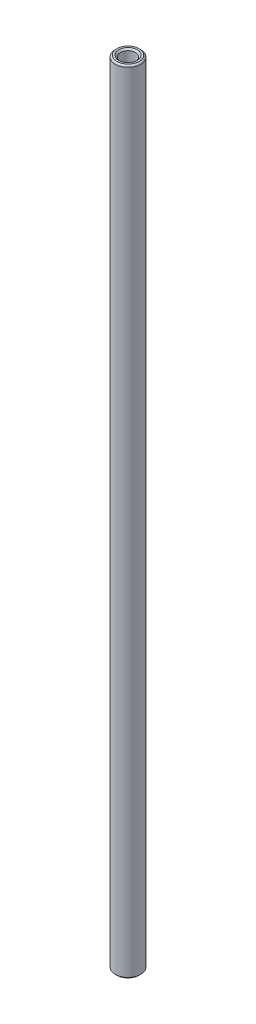
ISO-10303-21;
HEADER;
FILE_DESCRIPTION(('STEP AP214'),'2;1');
FILE_NAME('part.step','',(''),(''),'','','');
FILE_SCHEMA(('AUTOMOTIVE_DESIGN { 1 0 10303 214 1 1 1 1 }'));
ENDSEC;
DATA;
#1=APPLICATION_CONTEXT('core data for automotive mechanical design processes');
#2=APPLICATION_PROTOCOL_DEFINITION('international standard','automotive_design',2000,#1);
#3=PRODUCT_CONTEXT('',#1,'mechanical');
#4=PRODUCT('Part','Part','',(#3));
#5=PRODUCT_RELATED_PRODUCT_CATEGORY('part','',(#4));
#6=PRODUCT_DEFINITION_FORMATION('','',#4);
#7=PRODUCT_DEFINITION_CONTEXT('part definition',#1,'design');
#8=PRODUCT_DEFINITION('design','',#6,#7);
#9=PRODUCT_DEFINITION_SHAPE('','',#8);
#10=(LENGTH_UNIT() NAMED_UNIT(*) SI_UNIT(.MILLI.,.METRE.));
#11=(NAMED_UNIT(*) PLANE_ANGLE_UNIT() SI_UNIT($,.RADIAN.));
#12=(NAMED_UNIT(*) SI_UNIT($,.STERADIAN.) SOLID_ANGLE_UNIT());
#13=UNCERTAINTY_MEASURE_WITH_UNIT(LENGTH_MEASURE(1.E-05),#10,'distance_accuracy_value','');
#14=(GEOMETRIC_REPRESENTATION_CONTEXT(3) GLOBAL_UNCERTAINTY_ASSIGNED_CONTEXT((#13)) GLOBAL_UNIT_ASSIGNED_CONTEXT((#10,
#11,#12)) REPRESENTATION_CONTEXT('',''));
#15=CARTESIAN_POINT('',(0.,0.,0.));
#16=DIRECTION('',(0.,0.,1.));
#17=DIRECTION('',(1.,0.,0.));
#18=AXIS2_PLACEMENT_3D('',#15,#16,#17);
#19=CARTESIAN_POINT('',(0.,61.9125,0.));
#20=DIRECTION('',(0.,1.,0.));
#21=DIRECTION('',(0.,0.,1.));
#22=AXIS2_PLACEMENT_3D('',#19,#20,#21);
#23=PLANE('',#22);
#24=CARTESIAN_POINT('',(0.,61.9125,0.));
#25=DIRECTION('',(0.,1.,0.));
#26=DIRECTION('',(0.,0.,1.));
#27=AXIS2_PLACEMENT_3D('',#24,#25,#26);
#28=CIRCLE('',#27,1.444625);
#29=CARTESIAN_POINT('',(0.,61.9125,1.444625));
#30=VERTEX_POINT('',#29);
#31=EDGE_CURVE('E10',#30,#30,#28,.F.);
#32=ORIENTED_EDGE('',*,*,#31,.T.);
#33=EDGE_LOOP('',(#32));
#34=FACE_BOUND('',#33,.T.);
#35=CARTESIAN_POINT('',(0.,61.9125,0.));
#36=DIRECTION('',(0.,1.,0.));
#37=DIRECTION('',(0.,0.,1.));
#38=AXIS2_PLACEMENT_3D('',#35,#36,#37);
#39=CIRCLE('',#38,1.73037499999998);
#40=CARTESIAN_POINT('',(0.,61.9125,1.73037499999998));
#41=VERTEX_POINT('',#40);
#42=EDGE_CURVE('E41',#41,#41,#39,.T.);
#43=ORIENTED_EDGE('',*,*,#42,.T.);
#44=EDGE_LOOP('',(#43));
#45=FACE_BOUND('',#44,.T.);
#46=ADVANCED_FACE('F33',(#34,#45),#23,.T.);
#47=CARTESIAN_POINT('',(0.,-61.9125,0.));
#48=DIRECTION('',(0.,1.,0.));
#49=DIRECTION('',(0.,0.,1.));
#50=AXIS2_PLACEMENT_3D('',#47,#48,#49);
#51=PLANE('',#50);
#52=CARTESIAN_POINT('',(0.,-61.9125,0.));
#53=DIRECTION('',(0.,1.,0.));
#54=DIRECTION('',(0.,0.,1.));
#55=AXIS2_PLACEMENT_3D('',#52,#53,#54);
#56=CIRCLE('',#55,1.444625);
#57=CARTESIAN_POINT('',(0.,-61.9125,1.444625));
#58=VERTEX_POINT('',#57);
#59=EDGE_CURVE('E60',#58,#58,#56,.T.);
#60=ORIENTED_EDGE('',*,*,#59,.T.);
#61=EDGE_LOOP('',(#60));
#62=FACE_BOUND('',#61,.T.);
#63=CARTESIAN_POINT('',(0.,-61.9125,0.));
#64=DIRECTION('',(0.,1.,0.));
#65=DIRECTION('',(0.,0.,1.));
#66=AXIS2_PLACEMENT_3D('',#63,#64,#65);
#67=CIRCLE('',#66,1.73037500000005);
#68=CARTESIAN_POINT('',(0.,-61.9125,1.73037500000005));
#69=VERTEX_POINT('',#68);
#70=EDGE_CURVE('E63',#69,#69,#67,.F.);
#71=ORIENTED_EDGE('',*,*,#70,.T.);
#72=EDGE_LOOP('',(#71));
#73=FACE_BOUND('',#72,.T.);
#74=ADVANCED_FACE('F67',(#62,#73),#51,.F.);
#75=CARTESIAN_POINT('',(0.,61.9125,0.));
#76=DIRECTION('',(0.,-1.,0.));
#77=DIRECTION('',(0.,0.,-1.));
#78=AXIS2_PLACEMENT_3D('',#75,#76,#77);
#79=CYLINDRICAL_SURFACE('',#78,1.984375);
#80=CARTESIAN_POINT('',(0.,-61.6585,0.));
#81=DIRECTION('',(0.,1.,0.));
#82=DIRECTION('',(0.,0.,1.));
#83=AXIS2_PLACEMENT_3D('',#80,#81,#82);
#84=CIRCLE('',#83,1.984375);
#85=CARTESIAN_POINT('',(0.,-61.6585,1.984375));
#86=VERTEX_POINT('',#85);
#87=EDGE_CURVE('E45',#86,#86,#84,.T.);
#88=ORIENTED_EDGE('',*,*,#87,.T.);
#89=EDGE_LOOP('',(#88));
#90=FACE_BOUND('',#89,.T.);
#91=CARTESIAN_POINT('',(0.,61.6585,0.));
#92=DIRECTION('',(0.,1.,0.));
#93=DIRECTION('',(0.,0.,1.));
#94=AXIS2_PLACEMENT_3D('',#91,#92,#93);
#95=CIRCLE('',#94,1.984375);
#96=CARTESIAN_POINT('',(0.,61.6585,1.984375));
#97=VERTEX_POINT('',#96);
#98=EDGE_CURVE('E49',#97,#97,#95,.F.);
#99=ORIENTED_EDGE('',*,*,#98,.T.);
#100=EDGE_LOOP('',(#99));
#101=FACE_BOUND('',#100,.T.);
#102=ADVANCED_FACE('F77',(#90,#101),#79,.T.);
#103=CARTESIAN_POINT('',(0.,61.9125,0.));
#104=DIRECTION('',(0.,-1.,0.));
#105=DIRECTION('',(0.,0.,-1.));
#106=AXIS2_PLACEMENT_3D('',#103,#104,#105);
#107=CYLINDRICAL_SURFACE('',#106,1.190625);
#108=CARTESIAN_POINT('',(0.,-61.6585,0.));
#109=DIRECTION('',(0.,1.,0.));
#110=DIRECTION('',(0.,0.,1.));
#111=AXIS2_PLACEMENT_3D('',#108,#109,#110);
#112=CIRCLE('',#111,1.190625);
#113=CARTESIAN_POINT('',(0.,-61.6585,1.190625));
#114=VERTEX_POINT('',#113);
#115=EDGE_CURVE('E54',#114,#114,#112,.F.);
#116=ORIENTED_EDGE('',*,*,#115,.T.);
#117=EDGE_LOOP('',(#116));
#118=FACE_BOUND('',#117,.T.);
#119=CARTESIAN_POINT('',(0.,61.6585,0.));
#120=DIRECTION('',(0.,1.,0.));
#121=DIRECTION('',(0.,0.,1.));
#122=AXIS2_PLACEMENT_3D('',#119,#120,#121);
#123=CIRCLE('',#122,1.190625);
#124=CARTESIAN_POINT('',(0.,61.6585,1.190625));
#125=VERTEX_POINT('',#124);
#126=EDGE_CURVE('E57',#125,#125,#123,.T.);
#127=ORIENTED_EDGE('',*,*,#126,.T.);
#128=EDGE_LOOP('',(#127));
#129=FACE_BOUND('',#128,.T.);
#130=ADVANCED_FACE('F80',(#118,#129),#107,.F.);
#131=CARTESIAN_POINT('',(0.,-61.9125,0.));
#132=DIRECTION('',(0.,-1.,0.));
#133=DIRECTION('',(0.,0.,-1.));
#134=AXIS2_PLACEMENT_3D('',#131,#132,#133);
#135=CONICAL_SURFACE('',#134,1.444625,0.78539816339745);
#136=ORIENTED_EDGE('',*,*,#115,.F.);
#137=EDGE_LOOP('',(#136));
#138=FACE_BOUND('',#137,.T.);
#139=ORIENTED_EDGE('',*,*,#59,.F.);
#140=EDGE_LOOP('',(#139));
#141=FACE_BOUND('',#140,.T.);
#142=ADVANCED_FACE('F73',(#138,#141),#135,.F.);
#143=CARTESIAN_POINT('',(0.,-61.6585,0.));
#144=DIRECTION('',(0.,1.,0.));
#145=DIRECTION('',(0.,0.,1.));
#146=AXIS2_PLACEMENT_3D('',#143,#144,#145);
#147=CONICAL_SURFACE('',#146,1.984375,0.785398163397428);
#148=ORIENTED_EDGE('',*,*,#70,.F.);
#149=EDGE_LOOP('',(#148));
#150=FACE_BOUND('',#149,.T.);
#151=ORIENTED_EDGE('',*,*,#87,.F.);
#152=EDGE_LOOP('',(#151));
#153=FACE_BOUND('',#152,.T.);
#154=ADVANCED_FACE('F69',(#150,#153),#147,.T.);
#155=CARTESIAN_POINT('',(0.,61.6585,0.));
#156=DIRECTION('',(0.,1.,0.));
#157=DIRECTION('',(0.,0.,1.));
#158=AXIS2_PLACEMENT_3D('',#155,#156,#157);
#159=CONICAL_SURFACE('',#158,1.190625,0.78539816339745);
#160=ORIENTED_EDGE('',*,*,#31,.F.);
#161=EDGE_LOOP('',(#160));
#162=FACE_BOUND('',#161,.T.);
#163=ORIENTED_EDGE('',*,*,#126,.F.);
#164=EDGE_LOOP('',(#163));
#165=FACE_BOUND('',#164,.T.);
#166=ADVANCED_FACE('F72',(#162,#165),#159,.F.);
#167=CARTESIAN_POINT('',(0.,61.9125,0.));
#168=DIRECTION('',(0.,-1.,0.));
#169=DIRECTION('',(0.,0.,-1.));
#170=AXIS2_PLACEMENT_3D('',#167,#168,#169);
#171=CONICAL_SURFACE('',#170,1.73037499999998,0.785398163397442);
#172=ORIENTED_EDGE('',*,*,#98,.F.);
#173=EDGE_LOOP('',(#172));
#174=FACE_BOUND('',#173,.T.);
#175=ORIENTED_EDGE('',*,*,#42,.F.);
#176=EDGE_LOOP('',(#175));
#177=FACE_BOUND('',#176,.T.);
#178=ADVANCED_FACE('F36',(#174,#177),#171,.T.);
#179=CLOSED_SHELL('',(#46,#74,#102,#130,#142,#154,#166,#178));
#180=MANIFOLD_SOLID_BREP('B2',#179);
#181=ADVANCED_BREP_SHAPE_REPRESENTATION('',(#18,#180),#14);
#182=SHAPE_DEFINITION_REPRESENTATION(#9,#181);
ENDSEC;
END-ISO-10303-21;
